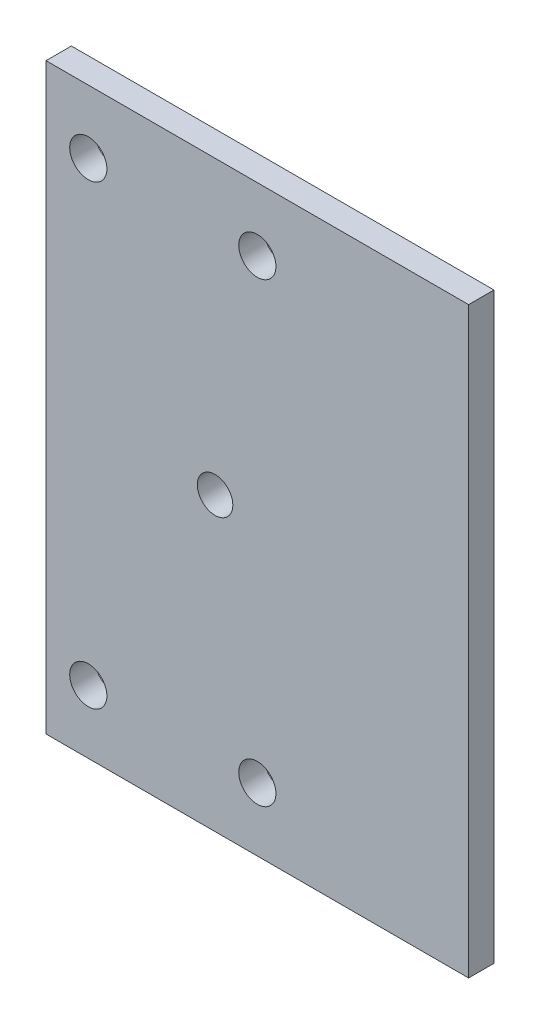
ISO-10303-21;
HEADER;
FILE_DESCRIPTION(('STEP AP214'),'2;1');
FILE_NAME('part.step','',(''),(''),'','','');
FILE_SCHEMA(('AUTOMOTIVE_DESIGN { 1 0 10303 214 1 1 1 1 }'));
ENDSEC;
DATA;
#1=APPLICATION_CONTEXT('core data for automotive mechanical design processes');
#2=APPLICATION_PROTOCOL_DEFINITION('international standard','automotive_design',2000,#1);
#3=PRODUCT_CONTEXT('',#1,'mechanical');
#4=PRODUCT('Part','Part','',(#3));
#5=PRODUCT_RELATED_PRODUCT_CATEGORY('part','',(#4));
#6=PRODUCT_DEFINITION_FORMATION('','',#4);
#7=PRODUCT_DEFINITION_CONTEXT('part definition',#1,'design');
#8=PRODUCT_DEFINITION('design','',#6,#7);
#9=PRODUCT_DEFINITION_SHAPE('','',#8);
#10=(LENGTH_UNIT() NAMED_UNIT(*) SI_UNIT(.MILLI.,.METRE.));
#11=(NAMED_UNIT(*) PLANE_ANGLE_UNIT() SI_UNIT($,.RADIAN.));
#12=(NAMED_UNIT(*) SI_UNIT($,.STERADIAN.) SOLID_ANGLE_UNIT());
#13=UNCERTAINTY_MEASURE_WITH_UNIT(LENGTH_MEASURE(1.E-05),#10,'distance_accuracy_value','');
#14=(GEOMETRIC_REPRESENTATION_CONTEXT(3) GLOBAL_UNCERTAINTY_ASSIGNED_CONTEXT((#13)) GLOBAL_UNIT_ASSIGNED_CONTEXT((#10,
#11,#12)) REPRESENTATION_CONTEXT('',''));
#15=CARTESIAN_POINT('',(0.,0.,0.));
#16=DIRECTION('',(0.,0.,1.));
#17=DIRECTION('',(1.,0.,0.));
#18=AXIS2_PLACEMENT_3D('',#15,#16,#17);
#19=CARTESIAN_POINT('',(0.,0.,3.));
#20=DIRECTION('',(0.,0.,1.));
#21=DIRECTION('',(1.,0.,0.));
#22=AXIS2_PLACEMENT_3D('',#19,#20,#21);
#23=PLANE('',#22);
#24=CARTESIAN_POINT('',(-25.,27.,3.));
#25=DIRECTION('',(0.,0.,1.));
#26=DIRECTION('',(1.,0.,0.));
#27=AXIS2_PLACEMENT_3D('',#24,#25,#26);
#28=CIRCLE('',#27,2.2);
#29=CARTESIAN_POINT('',(-22.8,27.,3.));
#30=VERTEX_POINT('',#29);
#31=EDGE_CURVE('E84',#30,#30,#28,.T.);
#32=ORIENTED_EDGE('',*,*,#31,.F.);
#33=EDGE_LOOP('',(#32));
#34=FACE_BOUND('',#33,.T.);
#35=CARTESIAN_POINT('',(-5.00000000000001,27.,3.));
#36=DIRECTION('',(0.,0.,1.));
#37=DIRECTION('',(1.,0.,0.));
#38=AXIS2_PLACEMENT_3D('',#35,#36,#37);
#39=CIRCLE('',#38,2.2);
#40=CARTESIAN_POINT('',(-2.80000000000001,27.,3.));
#41=VERTEX_POINT('',#40);
#42=EDGE_CURVE('E112',#41,#41,#39,.T.);
#43=ORIENTED_EDGE('',*,*,#42,.F.);
#44=EDGE_LOOP('',(#43));
#45=FACE_BOUND('',#44,.T.);
#46=CARTESIAN_POINT('',(-5.00000000000001,-27.,3.));
#47=DIRECTION('',(0.,0.,1.));
#48=DIRECTION('',(1.,0.,0.));
#49=AXIS2_PLACEMENT_3D('',#46,#47,#48);
#50=CIRCLE('',#49,2.2);
#51=CARTESIAN_POINT('',(-2.80000000000001,-27.,3.));
#52=VERTEX_POINT('',#51);
#53=EDGE_CURVE('E115',#52,#52,#50,.T.);
#54=ORIENTED_EDGE('',*,*,#53,.F.);
#55=EDGE_LOOP('',(#54));
#56=FACE_BOUND('',#55,.T.);
#57=CARTESIAN_POINT('',(-25.,-27.,3.));
#58=DIRECTION('',(0.,0.,1.));
#59=DIRECTION('',(1.,0.,0.));
#60=AXIS2_PLACEMENT_3D('',#57,#58,#59);
#61=CIRCLE('',#60,2.2);
#62=CARTESIAN_POINT('',(-22.8,-27.,3.));
#63=VERTEX_POINT('',#62);
#64=EDGE_CURVE('E118',#63,#63,#61,.T.);
#65=ORIENTED_EDGE('',*,*,#64,.F.);
#66=EDGE_LOOP('',(#65));
#67=FACE_BOUND('',#66,.T.);
#68=CARTESIAN_POINT('',(-9.99999999999999,0.,3.));
#69=DIRECTION('',(0.,0.,1.));
#70=DIRECTION('',(1.,0.,0.));
#71=AXIS2_PLACEMENT_3D('',#68,#69,#70);
#72=CIRCLE('',#71,2.1);
#73=CARTESIAN_POINT('',(-7.89999999999999,0.,3.));
#74=VERTEX_POINT('',#73);
#75=EDGE_CURVE('E105',#74,#74,#72,.T.);
#76=ORIENTED_EDGE('',*,*,#75,.F.);
#77=EDGE_LOOP('',(#76));
#78=FACE_BOUND('',#77,.T.);
#79=DIRECTION('',(1.,0.,0.));
#80=VECTOR('',#79,1.);
#81=CARTESIAN_POINT('',(-20.,34.5,3.));
#82=LINE('',#81,#80);
#83=CARTESIAN_POINT('',(-30.,34.5,3.));
#84=VERTEX_POINT('',#83);
#85=CARTESIAN_POINT('',(20.,34.5,3.));
#86=VERTEX_POINT('',#85);
#87=EDGE_CURVE('E89',#84,#86,#82,.T.);
#88=ORIENTED_EDGE('',*,*,#87,.F.);
#89=DIRECTION('',(0.,1.,0.));
#90=VECTOR('',#89,1.);
#91=CARTESIAN_POINT('',(-30.,-34.5,3.));
#92=LINE('',#91,#90);
#93=CARTESIAN_POINT('',(-30.,-34.5,3.));
#94=VERTEX_POINT('',#93);
#95=EDGE_CURVE('E75',#94,#84,#92,.T.);
#96=ORIENTED_EDGE('',*,*,#95,.F.);
#97=DIRECTION('',(-1.,0.,0.));
#98=VECTOR('',#97,1.);
#99=CARTESIAN_POINT('',(20.,-34.5,3.));
#100=LINE('',#99,#98);
#101=CARTESIAN_POINT('',(20.,-34.5,3.));
#102=VERTEX_POINT('',#101);
#103=EDGE_CURVE('E97',#102,#94,#100,.T.);
#104=ORIENTED_EDGE('',*,*,#103,.F.);
#105=DIRECTION('',(0.,1.,0.));
#106=VECTOR('',#105,1.);
#107=CARTESIAN_POINT('',(20.,14.5,3.));
#108=LINE('',#107,#106);
#109=EDGE_CURVE('E11',#102,#86,#108,.T.);
#110=ORIENTED_EDGE('',*,*,#109,.T.);
#111=EDGE_LOOP('',(#88,#96,#104,#110));
#112=FACE_BOUND('',#111,.T.);
#113=ADVANCED_FACE('F33',(#34,#45,#56,#67,#78,#112),#23,.T.);
#114=CARTESIAN_POINT('',(0.,0.,0.));
#115=DIRECTION('',(0.,0.,1.));
#116=DIRECTION('',(1.,0.,0.));
#117=AXIS2_PLACEMENT_3D('',#114,#115,#116);
#118=PLANE('',#117);
#119=CARTESIAN_POINT('',(-25.,27.,0.));
#120=DIRECTION('',(0.,0.,-1.));
#121=DIRECTION('',(-1.,0.,0.));
#122=AXIS2_PLACEMENT_3D('',#119,#120,#121);
#123=CIRCLE('',#122,2.2);
#124=CARTESIAN_POINT('',(-27.2,27.,0.));
#125=VERTEX_POINT('',#124);
#126=EDGE_CURVE('E125',#125,#125,#123,.T.);
#127=ORIENTED_EDGE('',*,*,#126,.F.);
#128=EDGE_LOOP('',(#127));
#129=FACE_BOUND('',#128,.T.);
#130=CARTESIAN_POINT('',(-5.00000000000001,27.,0.));
#131=DIRECTION('',(0.,0.,-1.));
#132=DIRECTION('',(-1.,0.,0.));
#133=AXIS2_PLACEMENT_3D('',#130,#131,#132);
#134=CIRCLE('',#133,2.2);
#135=CARTESIAN_POINT('',(-7.20000000000001,27.,0.));
#136=VERTEX_POINT('',#135);
#137=EDGE_CURVE('E128',#136,#136,#134,.T.);
#138=ORIENTED_EDGE('',*,*,#137,.F.);
#139=EDGE_LOOP('',(#138));
#140=FACE_BOUND('',#139,.T.);
#141=CARTESIAN_POINT('',(-5.00000000000001,-27.,0.));
#142=DIRECTION('',(0.,0.,-1.));
#143=DIRECTION('',(-1.,0.,0.));
#144=AXIS2_PLACEMENT_3D('',#141,#142,#143);
#145=CIRCLE('',#144,2.2);
#146=CARTESIAN_POINT('',(-7.20000000000001,-27.,0.));
#147=VERTEX_POINT('',#146);
#148=EDGE_CURVE('E124',#147,#147,#145,.T.);
#149=ORIENTED_EDGE('',*,*,#148,.F.);
#150=EDGE_LOOP('',(#149));
#151=FACE_BOUND('',#150,.T.);
#152=CARTESIAN_POINT('',(-25.,-27.,0.));
#153=DIRECTION('',(0.,0.,-1.));
#154=DIRECTION('',(-1.,0.,0.));
#155=AXIS2_PLACEMENT_3D('',#152,#153,#154);
#156=CIRCLE('',#155,2.2);
#157=CARTESIAN_POINT('',(-27.2,-27.,0.));
#158=VERTEX_POINT('',#157);
#159=EDGE_CURVE('E121',#158,#158,#156,.T.);
#160=ORIENTED_EDGE('',*,*,#159,.F.);
#161=EDGE_LOOP('',(#160));
#162=FACE_BOUND('',#161,.T.);
#163=CARTESIAN_POINT('',(-9.99999999999999,0.,0.));
#164=DIRECTION('',(0.,0.,1.));
#165=DIRECTION('',(1.,0.,0.));
#166=AXIS2_PLACEMENT_3D('',#163,#164,#165);
#167=CIRCLE('',#166,2.1);
#168=CARTESIAN_POINT('',(-7.89999999999999,0.,0.));
#169=VERTEX_POINT('',#168);
#170=EDGE_CURVE('E37',#169,#169,#167,.T.);
#171=ORIENTED_EDGE('',*,*,#170,.T.);
#172=EDGE_LOOP('',(#171));
#173=FACE_BOUND('',#172,.T.);
#174=DIRECTION('',(0.,-1.,0.));
#175=VECTOR('',#174,1.);
#176=CARTESIAN_POINT('',(-30.,-34.5,0.));
#177=LINE('',#176,#175);
#178=CARTESIAN_POINT('',(-30.,34.5,0.));
#179=VERTEX_POINT('',#178);
#180=CARTESIAN_POINT('',(-30.,-34.5,0.));
#181=VERTEX_POINT('',#180);
#182=EDGE_CURVE('E50',#179,#181,#177,.T.);
#183=ORIENTED_EDGE('',*,*,#182,.F.);
#184=DIRECTION('',(-1.,0.,0.));
#185=VECTOR('',#184,1.);
#186=CARTESIAN_POINT('',(-20.,34.5,0.));
#187=LINE('',#186,#185);
#188=CARTESIAN_POINT('',(20.,34.5,0.));
#189=VERTEX_POINT('',#188);
#190=EDGE_CURVE('E91',#189,#179,#187,.T.);
#191=ORIENTED_EDGE('',*,*,#190,.F.);
#192=DIRECTION('',(0.,1.,0.));
#193=VECTOR('',#192,1.);
#194=CARTESIAN_POINT('',(20.,14.5,0.));
#195=LINE('',#194,#193);
#196=CARTESIAN_POINT('',(20.,-34.5,0.));
#197=VERTEX_POINT('',#196);
#198=EDGE_CURVE('E42',#197,#189,#195,.T.);
#199=ORIENTED_EDGE('',*,*,#198,.F.);
#200=DIRECTION('',(1.,0.,0.));
#201=VECTOR('',#200,1.);
#202=CARTESIAN_POINT('',(20.,-34.5,0.));
#203=LINE('',#202,#201);
#204=EDGE_CURVE('E94',#181,#197,#203,.T.);
#205=ORIENTED_EDGE('',*,*,#204,.F.);
#206=EDGE_LOOP('',(#183,#191,#199,#205));
#207=FACE_BOUND('',#206,.T.);
#208=ADVANCED_FACE('F136',(#129,#140,#151,#162,#173,#207),#118,.F.);
#209=CARTESIAN_POINT('',(0.,34.5,0.));
#210=DIRECTION('',(0.,-1.,0.));
#211=DIRECTION('',(0.,0.,-1.));
#212=AXIS2_PLACEMENT_3D('',#209,#210,#211);
#213=PLANE('',#212);
#214=DIRECTION('',(0.,0.,-1.));
#215=VECTOR('',#214,1.);
#216=CARTESIAN_POINT('',(-30.,34.5,3.));
#217=LINE('',#216,#215);
#218=EDGE_CURVE('E78',#84,#179,#217,.T.);
#219=ORIENTED_EDGE('',*,*,#218,.F.);
#220=ORIENTED_EDGE('',*,*,#87,.T.);
#221=DIRECTION('',(0.,0.,-1.));
#222=VECTOR('',#221,1.);
#223=CARTESIAN_POINT('',(20.,34.5,3.));
#224=LINE('',#223,#222);
#225=EDGE_CURVE('E93',#86,#189,#224,.T.);
#226=ORIENTED_EDGE('',*,*,#225,.T.);
#227=ORIENTED_EDGE('',*,*,#190,.T.);
#228=EDGE_LOOP('',(#219,#220,#226,#227));
#229=FACE_BOUND('',#228,.T.);
#230=ADVANCED_FACE('F88',(#229),#213,.F.);
#231=CARTESIAN_POINT('',(0.,-34.5,0.));
#232=DIRECTION('',(0.,1.,0.));
#233=DIRECTION('',(0.,0.,1.));
#234=AXIS2_PLACEMENT_3D('',#231,#232,#233);
#235=PLANE('',#234);
#236=DIRECTION('',(0.,0.,1.));
#237=VECTOR('',#236,1.);
#238=CARTESIAN_POINT('',(-30.,-34.5,3.));
#239=LINE('',#238,#237);
#240=EDGE_CURVE('E79',#181,#94,#239,.T.);
#241=ORIENTED_EDGE('',*,*,#240,.F.);
#242=ORIENTED_EDGE('',*,*,#204,.T.);
#243=DIRECTION('',(0.,0.,1.));
#244=VECTOR('',#243,1.);
#245=CARTESIAN_POINT('',(20.,-34.5,3.));
#246=LINE('',#245,#244);
#247=EDGE_CURVE('E102',#197,#102,#246,.T.);
#248=ORIENTED_EDGE('',*,*,#247,.T.);
#249=ORIENTED_EDGE('',*,*,#103,.T.);
#250=EDGE_LOOP('',(#241,#242,#248,#249));
#251=FACE_BOUND('',#250,.T.);
#252=ADVANCED_FACE('F147',(#251),#235,.F.);
#253=CARTESIAN_POINT('',(20.,14.5,3.));
#254=DIRECTION('',(-1.,0.,0.));
#255=DIRECTION('',(0.,-1.,0.));
#256=AXIS2_PLACEMENT_3D('',#253,#254,#255);
#257=PLANE('',#256);
#258=ORIENTED_EDGE('',*,*,#198,.T.);
#259=ORIENTED_EDGE('',*,*,#225,.F.);
#260=ORIENTED_EDGE('',*,*,#109,.F.);
#261=ORIENTED_EDGE('',*,*,#247,.F.);
#262=EDGE_LOOP('',(#258,#259,#260,#261));
#263=FACE_BOUND('',#262,.T.);
#264=ADVANCED_FACE('F35',(#263),#257,.F.);
#265=CARTESIAN_POINT('',(-9.99999999999999,0.,-7.));
#266=DIRECTION('',(0.,0.,1.));
#267=DIRECTION('',(1.,0.,0.));
#268=AXIS2_PLACEMENT_3D('',#265,#266,#267);
#269=CYLINDRICAL_SURFACE('',#268,2.1);
#270=ORIENTED_EDGE('',*,*,#75,.T.);
#271=EDGE_LOOP('',(#270));
#272=FACE_BOUND('',#271,.T.);
#273=ORIENTED_EDGE('',*,*,#170,.F.);
#274=EDGE_LOOP('',(#273));
#275=FACE_BOUND('',#274,.T.);
#276=ADVANCED_FACE('F149',(#272,#275),#269,.F.);
#277=CARTESIAN_POINT('',(-30.,0.,0.));
#278=DIRECTION('',(-1.,0.,0.));
#279=DIRECTION('',(0.,-1.,0.));
#280=AXIS2_PLACEMENT_3D('',#277,#278,#279);
#281=PLANE('',#280);
#282=ORIENTED_EDGE('',*,*,#95,.T.);
#283=ORIENTED_EDGE('',*,*,#218,.T.);
#284=ORIENTED_EDGE('',*,*,#182,.T.);
#285=ORIENTED_EDGE('',*,*,#240,.T.);
#286=EDGE_LOOP('',(#282,#283,#284,#285));
#287=FACE_BOUND('',#286,.T.);
#288=ADVANCED_FACE('F77',(#287),#281,.T.);
#289=CARTESIAN_POINT('',(-25.,-27.,10.));
#290=DIRECTION('',(0.,0.,-1.));
#291=DIRECTION('',(-1.,0.,0.));
#292=AXIS2_PLACEMENT_3D('',#289,#290,#291);
#293=CYLINDRICAL_SURFACE('',#292,2.2);
#294=ORIENTED_EDGE('',*,*,#64,.T.);
#295=EDGE_LOOP('',(#294));
#296=FACE_BOUND('',#295,.T.);
#297=ORIENTED_EDGE('',*,*,#159,.T.);
#298=EDGE_LOOP('',(#297));
#299=FACE_BOUND('',#298,.T.);
#300=ADVANCED_FACE('F169',(#296,#299),#293,.F.);
#301=CARTESIAN_POINT('',(-5.00000000000001,-27.,10.));
#302=DIRECTION('',(0.,0.,-1.));
#303=DIRECTION('',(-1.,0.,0.));
#304=AXIS2_PLACEMENT_3D('',#301,#302,#303);
#305=CYLINDRICAL_SURFACE('',#304,2.2);
#306=ORIENTED_EDGE('',*,*,#53,.T.);
#307=EDGE_LOOP('',(#306));
#308=FACE_BOUND('',#307,.T.);
#309=ORIENTED_EDGE('',*,*,#148,.T.);
#310=EDGE_LOOP('',(#309));
#311=FACE_BOUND('',#310,.T.);
#312=ADVANCED_FACE('F134',(#308,#311),#305,.F.);
#313=CARTESIAN_POINT('',(-5.00000000000001,27.,10.));
#314=DIRECTION('',(0.,0.,-1.));
#315=DIRECTION('',(-1.,0.,0.));
#316=AXIS2_PLACEMENT_3D('',#313,#314,#315);
#317=CYLINDRICAL_SURFACE('',#316,2.2);
#318=ORIENTED_EDGE('',*,*,#42,.T.);
#319=EDGE_LOOP('',(#318));
#320=FACE_BOUND('',#319,.T.);
#321=ORIENTED_EDGE('',*,*,#137,.T.);
#322=EDGE_LOOP('',(#321));
#323=FACE_BOUND('',#322,.T.);
#324=ADVANCED_FACE('F176',(#320,#323),#317,.F.);
#325=CARTESIAN_POINT('',(-25.,27.,10.));
#326=DIRECTION('',(0.,0.,-1.));
#327=DIRECTION('',(-1.,0.,0.));
#328=AXIS2_PLACEMENT_3D('',#325,#326,#327);
#329=CYLINDRICAL_SURFACE('',#328,2.2);
#330=ORIENTED_EDGE('',*,*,#31,.T.);
#331=EDGE_LOOP('',(#330));
#332=FACE_BOUND('',#331,.T.);
#333=ORIENTED_EDGE('',*,*,#126,.T.);
#334=EDGE_LOOP('',(#333));
#335=FACE_BOUND('',#334,.T.);
#336=ADVANCED_FACE('F173',(#332,#335),#329,.F.);
#337=CLOSED_SHELL('',(#113,#208,#230,#252,#264,#276,#288,#300,#312,#324,#336));
#338=MANIFOLD_SOLID_BREP('B2',#337);
#339=ADVANCED_BREP_SHAPE_REPRESENTATION('',(#18,#338),#14);
#340=SHAPE_DEFINITION_REPRESENTATION(#9,#339);
ENDSEC;
END-ISO-10303-21;
